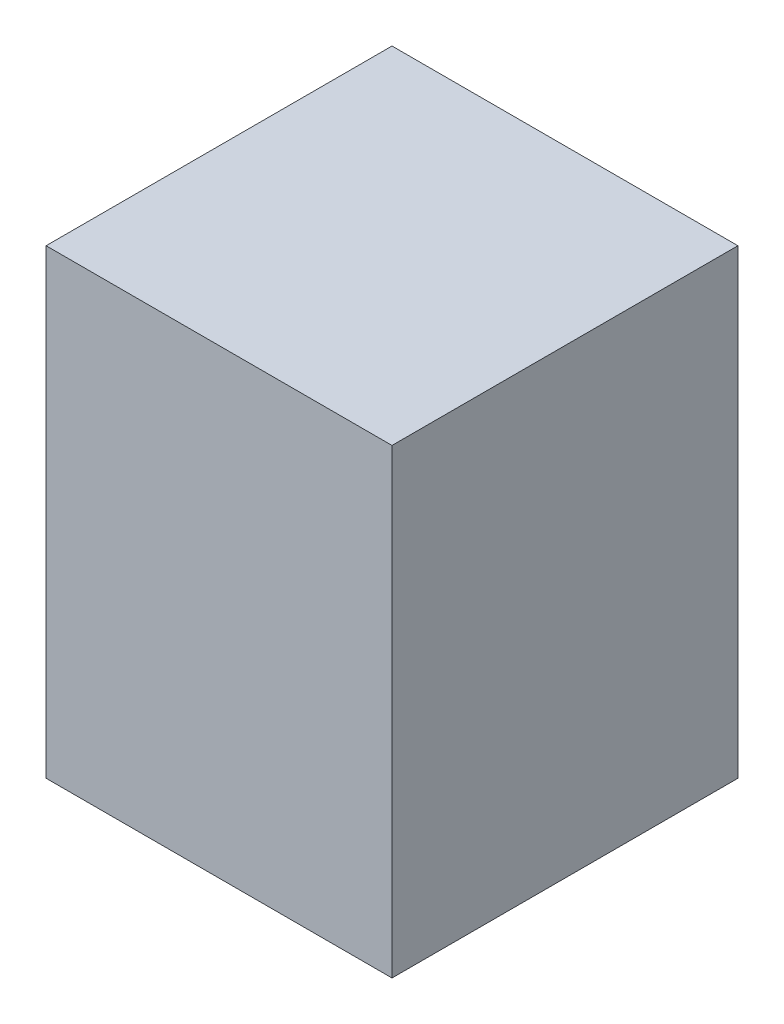
ISO-10303-21;
HEADER;
FILE_DESCRIPTION(('STEP AP214'),'2;1');
FILE_NAME('part.step','',(''),(''),'','','');
FILE_SCHEMA(('AUTOMOTIVE_DESIGN { 1 0 10303 214 1 1 1 1 }'));
ENDSEC;
DATA;
#1=APPLICATION_CONTEXT('core data for automotive mechanical design processes');
#2=APPLICATION_PROTOCOL_DEFINITION('international standard','automotive_design',2000,#1);
#3=PRODUCT_CONTEXT('',#1,'mechanical');
#4=PRODUCT('Part','Part','',(#3));
#5=PRODUCT_RELATED_PRODUCT_CATEGORY('part','',(#4));
#6=PRODUCT_DEFINITION_FORMATION('','',#4);
#7=PRODUCT_DEFINITION_CONTEXT('part definition',#1,'design');
#8=PRODUCT_DEFINITION('design','',#6,#7);
#9=PRODUCT_DEFINITION_SHAPE('','',#8);
#10=(LENGTH_UNIT() NAMED_UNIT(*) SI_UNIT(.MILLI.,.METRE.));
#11=(NAMED_UNIT(*) PLANE_ANGLE_UNIT() SI_UNIT($,.RADIAN.));
#12=(NAMED_UNIT(*) SI_UNIT($,.STERADIAN.) SOLID_ANGLE_UNIT());
#13=UNCERTAINTY_MEASURE_WITH_UNIT(LENGTH_MEASURE(1.E-05),#10,'distance_accuracy_value','');
#14=(GEOMETRIC_REPRESENTATION_CONTEXT(3) GLOBAL_UNCERTAINTY_ASSIGNED_CONTEXT((#13)) GLOBAL_UNIT_ASSIGNED_CONTEXT((#10,
#11,#12)) REPRESENTATION_CONTEXT('',''));
#15=CARTESIAN_POINT('',(0.,0.,0.));
#16=DIRECTION('',(0.,0.,1.));
#17=DIRECTION('',(1.,0.,0.));
#18=AXIS2_PLACEMENT_3D('',#15,#16,#17);
#19=CARTESIAN_POINT('',(0.,25.4,0.));
#20=DIRECTION('',(1.,0.,0.));
#21=DIRECTION('',(0.,0.,-1.));
#22=AXIS2_PLACEMENT_3D('',#19,#20,#21);
#23=PLANE('',#22);
#24=DIRECTION('',(0.,0.,1.));
#25=VECTOR('',#24,1.);
#26=CARTESIAN_POINT('',(0.,0.,0.));
#27=LINE('',#26,#25);
#28=CARTESIAN_POINT('',(0.,0.,-19.05));
#29=VERTEX_POINT('',#28);
#30=CARTESIAN_POINT('',(0.,0.,0.));
#31=VERTEX_POINT('',#30);
#32=EDGE_CURVE('E97',#29,#31,#27,.T.);
#33=ORIENTED_EDGE('',*,*,#32,.T.);
#34=DIRECTION('',(0.,-1.,0.));
#35=VECTOR('',#34,1.);
#36=CARTESIAN_POINT('',(0.,25.4,0.));
#37=LINE('',#36,#35);
#38=CARTESIAN_POINT('',(0.,25.4,0.));
#39=VERTEX_POINT('',#38);
#40=EDGE_CURVE('E11',#39,#31,#37,.T.);
#41=ORIENTED_EDGE('',*,*,#40,.F.);
#42=DIRECTION('',(0.,0.,1.));
#43=VECTOR('',#42,1.);
#44=CARTESIAN_POINT('',(0.,25.4,0.));
#45=LINE('',#44,#43);
#46=CARTESIAN_POINT('',(0.,25.4,-19.05));
#47=VERTEX_POINT('',#46);
#48=EDGE_CURVE('E85',#47,#39,#45,.T.);
#49=ORIENTED_EDGE('',*,*,#48,.F.);
#50=DIRECTION('',(0.,-1.,0.));
#51=VECTOR('',#50,1.);
#52=CARTESIAN_POINT('',(0.,25.4,-19.05));
#53=LINE('',#52,#51);
#54=EDGE_CURVE('E93',#47,#29,#53,.T.);
#55=ORIENTED_EDGE('',*,*,#54,.T.);
#56=EDGE_LOOP('',(#33,#41,#49,#55));
#57=FACE_BOUND('',#56,.T.);
#58=ADVANCED_FACE('F34',(#57),#23,.F.);
#59=CARTESIAN_POINT('',(0.,25.4,0.));
#60=DIRECTION('',(0.,0.,-1.));
#61=DIRECTION('',(-1.,0.,0.));
#62=AXIS2_PLACEMENT_3D('',#59,#60,#61);
#63=PLANE('',#62);
#64=DIRECTION('',(1.,0.,0.));
#65=VECTOR('',#64,1.);
#66=CARTESIAN_POINT('',(0.,0.,0.));
#67=LINE('',#66,#65);
#68=CARTESIAN_POINT('',(19.05,0.,0.));
#69=VERTEX_POINT('',#68);
#70=EDGE_CURVE('E89',#31,#69,#67,.T.);
#71=ORIENTED_EDGE('',*,*,#70,.T.);
#72=DIRECTION('',(0.,-1.,0.));
#73=VECTOR('',#72,1.);
#74=CARTESIAN_POINT('',(19.05,25.4,0.));
#75=LINE('',#74,#73);
#76=CARTESIAN_POINT('',(19.05,25.4,0.));
#77=VERTEX_POINT('',#76);
#78=EDGE_CURVE('E42',#77,#69,#75,.T.);
#79=ORIENTED_EDGE('',*,*,#78,.F.);
#80=DIRECTION('',(1.,0.,0.));
#81=VECTOR('',#80,1.);
#82=CARTESIAN_POINT('',(0.,25.4,0.));
#83=LINE('',#82,#81);
#84=EDGE_CURVE('E80',#39,#77,#83,.T.);
#85=ORIENTED_EDGE('',*,*,#84,.F.);
#86=ORIENTED_EDGE('',*,*,#40,.T.);
#87=EDGE_LOOP('',(#71,#79,#85,#86));
#88=FACE_BOUND('',#87,.T.);
#89=ADVANCED_FACE('F88',(#88),#63,.F.);
#90=CARTESIAN_POINT('',(19.05,25.4,0.));
#91=DIRECTION('',(-1.,0.,0.));
#92=DIRECTION('',(0.,0.,1.));
#93=AXIS2_PLACEMENT_3D('',#90,#91,#92);
#94=PLANE('',#93);
#95=DIRECTION('',(0.,0.,-1.));
#96=VECTOR('',#95,1.);
#97=CARTESIAN_POINT('',(19.05,0.,0.));
#98=LINE('',#97,#96);
#99=CARTESIAN_POINT('',(19.05,0.,-19.05));
#100=VERTEX_POINT('',#99);
#101=EDGE_CURVE('E67',#69,#100,#98,.T.);
#102=ORIENTED_EDGE('',*,*,#101,.T.);
#103=DIRECTION('',(0.,-1.,0.));
#104=VECTOR('',#103,1.);
#105=CARTESIAN_POINT('',(19.05,25.4,-19.05));
#106=LINE('',#105,#104);
#107=CARTESIAN_POINT('',(19.05,25.4,-19.05));
#108=VERTEX_POINT('',#107);
#109=EDGE_CURVE('E90',#108,#100,#106,.T.);
#110=ORIENTED_EDGE('',*,*,#109,.F.);
#111=DIRECTION('',(0.,0.,-1.));
#112=VECTOR('',#111,1.);
#113=CARTESIAN_POINT('',(19.05,25.4,0.));
#114=LINE('',#113,#112);
#115=EDGE_CURVE('E83',#77,#108,#114,.T.);
#116=ORIENTED_EDGE('',*,*,#115,.F.);
#117=ORIENTED_EDGE('',*,*,#78,.T.);
#118=EDGE_LOOP('',(#102,#110,#116,#117));
#119=FACE_BOUND('',#118,.T.);
#120=ADVANCED_FACE('F91',(#119),#94,.F.);
#121=CARTESIAN_POINT('',(0.,25.4,-19.05));
#122=DIRECTION('',(0.,0.,1.));
#123=DIRECTION('',(1.,0.,0.));
#124=AXIS2_PLACEMENT_3D('',#121,#122,#123);
#125=PLANE('',#124);
#126=DIRECTION('',(-1.,0.,0.));
#127=VECTOR('',#126,1.);
#128=CARTESIAN_POINT('',(0.,0.,-19.05));
#129=LINE('',#128,#127);
#130=EDGE_CURVE('E73',#100,#29,#129,.T.);
#131=ORIENTED_EDGE('',*,*,#130,.T.);
#132=ORIENTED_EDGE('',*,*,#54,.F.);
#133=DIRECTION('',(-1.,0.,0.));
#134=VECTOR('',#133,1.);
#135=CARTESIAN_POINT('',(0.,25.4,-19.05));
#136=LINE('',#135,#134);
#137=EDGE_CURVE('E50',#108,#47,#136,.T.);
#138=ORIENTED_EDGE('',*,*,#137,.F.);
#139=ORIENTED_EDGE('',*,*,#109,.T.);
#140=EDGE_LOOP('',(#131,#132,#138,#139));
#141=FACE_BOUND('',#140,.T.);
#142=ADVANCED_FACE('F104',(#141),#125,.F.);
#143=CARTESIAN_POINT('',(0.,25.4,0.));
#144=DIRECTION('',(0.,-1.,0.));
#145=DIRECTION('',(0.,0.,-1.));
#146=AXIS2_PLACEMENT_3D('',#143,#144,#145);
#147=PLANE('',#146);
#148=ORIENTED_EDGE('',*,*,#48,.T.);
#149=ORIENTED_EDGE('',*,*,#84,.T.);
#150=ORIENTED_EDGE('',*,*,#115,.T.);
#151=ORIENTED_EDGE('',*,*,#137,.T.);
#152=EDGE_LOOP('',(#148,#149,#150,#151));
#153=FACE_BOUND('',#152,.T.);
#154=ADVANCED_FACE('F81',(#153),#147,.F.);
#155=CARTESIAN_POINT('',(0.,0.,0.));
#156=DIRECTION('',(0.,-1.,0.));
#157=DIRECTION('',(0.,0.,-1.));
#158=AXIS2_PLACEMENT_3D('',#155,#156,#157);
#159=PLANE('',#158);
#160=ORIENTED_EDGE('',*,*,#32,.F.);
#161=ORIENTED_EDGE('',*,*,#130,.F.);
#162=ORIENTED_EDGE('',*,*,#101,.F.);
#163=ORIENTED_EDGE('',*,*,#70,.F.);
#164=EDGE_LOOP('',(#160,#161,#162,#163));
#165=FACE_BOUND('',#164,.T.);
#166=ADVANCED_FACE('F107',(#165),#159,.T.);
#167=CLOSED_SHELL('',(#58,#89,#120,#142,#154,#166));
#168=MANIFOLD_SOLID_BREP('B2',#167);
#169=ADVANCED_BREP_SHAPE_REPRESENTATION('',(#18,#168),#14);
#170=SHAPE_DEFINITION_REPRESENTATION(#9,#169);
ENDSEC;
END-ISO-10303-21;
